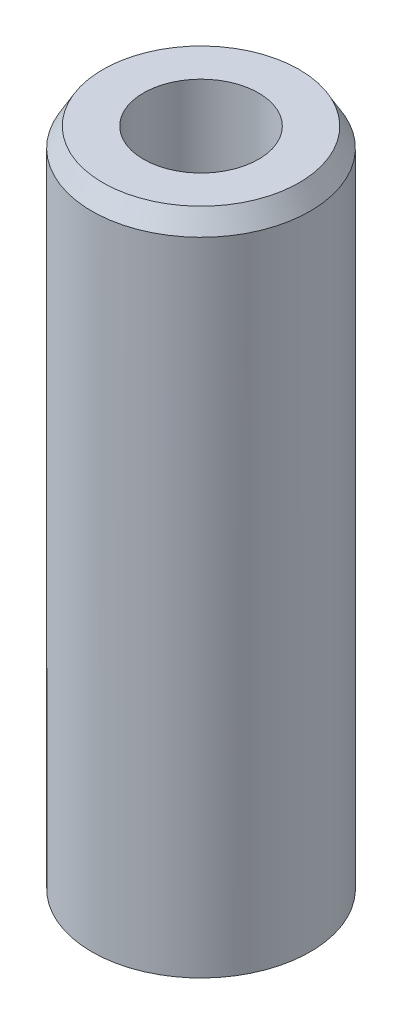
ISO-10303-21;
HEADER;
FILE_DESCRIPTION(('STEP AP214'),'2;1');
FILE_NAME('part.step','',(''),(''),'','','');
FILE_SCHEMA(('AUTOMOTIVE_DESIGN { 1 0 10303 214 1 1 1 1 }'));
ENDSEC;
DATA;
#1=APPLICATION_CONTEXT('core data for automotive mechanical design processes');
#2=APPLICATION_PROTOCOL_DEFINITION('international standard','automotive_design',2000,#1);
#3=PRODUCT_CONTEXT('',#1,'mechanical');
#4=PRODUCT('Part','Part','',(#3));
#5=PRODUCT_RELATED_PRODUCT_CATEGORY('part','',(#4));
#6=PRODUCT_DEFINITION_FORMATION('','',#4);
#7=PRODUCT_DEFINITION_CONTEXT('part definition',#1,'design');
#8=PRODUCT_DEFINITION('design','',#6,#7);
#9=PRODUCT_DEFINITION_SHAPE('','',#8);
#10=(LENGTH_UNIT() NAMED_UNIT(*) SI_UNIT(.MILLI.,.METRE.));
#11=(NAMED_UNIT(*) PLANE_ANGLE_UNIT() SI_UNIT($,.RADIAN.));
#12=(NAMED_UNIT(*) SI_UNIT($,.STERADIAN.) SOLID_ANGLE_UNIT());
#13=UNCERTAINTY_MEASURE_WITH_UNIT(LENGTH_MEASURE(1.E-05),#10,'distance_accuracy_value','');
#14=(GEOMETRIC_REPRESENTATION_CONTEXT(3) GLOBAL_UNCERTAINTY_ASSIGNED_CONTEXT((#13)) GLOBAL_UNIT_ASSIGNED_CONTEXT((#10,
#11,#12)) REPRESENTATION_CONTEXT('',''));
#15=CARTESIAN_POINT('',(0.,0.,0.));
#16=DIRECTION('',(0.,0.,1.));
#17=DIRECTION('',(1.,0.,0.));
#18=AXIS2_PLACEMENT_3D('',#15,#16,#17);
#19=CARTESIAN_POINT('',(0.,107.656707819467,0.));
#20=DIRECTION('',(0.,-1.,0.));
#21=DIRECTION('',(0.,0.,-1.));
#22=AXIS2_PLACEMENT_3D('',#19,#20,#21);
#23=CYLINDRICAL_SURFACE('',#22,17.5);
#24=CARTESIAN_POINT('',(0.,104.593815060946,0.));
#25=DIRECTION('',(0.,1.,0.));
#26=DIRECTION('',(0.,0.,1.));
#27=AXIS2_PLACEMENT_3D('',#24,#25,#26);
#28=CIRCLE('',#27,17.5);
#29=CARTESIAN_POINT('',(0.,104.593815060946,-17.5));
#30=VERTEX_POINT('',#29);
#31=EDGE_CURVE('E50',#30,#30,#28,.F.);
#32=CARTESIAN_POINT('',(0.,1.76836195863095,0.));
#33=DIRECTION('',(0.,1.,0.));
#34=DIRECTION('',(0.,0.,1.));
#35=AXIS2_PLACEMENT_3D('',#32,#33,#34);
#36=CIRCLE('',#35,17.5);
#37=CARTESIAN_POINT('',(0.,1.76836195863095,-17.5));
#38=VERTEX_POINT('',#37);
#39=EDGE_CURVE('E51',#38,#38,#36,.T.);
#40=CARTESIAN_POINT('',(0.,104.593815060946,-17.5));
#41=CARTESIAN_POINT('',(0.,103.52271659113,-17.5));
#42=CARTESIAN_POINT('',(0.,102.451618121315,-17.5));
#43=CARTESIAN_POINT('',(0.,100.309421181683,-17.5));
#44=CARTESIAN_POINT('',(0.,99.2383227118673,-17.5));
#45=CARTESIAN_POINT('',(0.,97.0961257722357,-17.5));
#46=CARTESIAN_POINT('',(0.,96.0250273024199,-17.5));
#47=CARTESIAN_POINT('',(0.,93.8828303627884,-17.5));
#48=CARTESIAN_POINT('',(0.,92.8117318929726,-17.5));
#49=CARTESIAN_POINT('',(0.,90.669534953341,-17.5));
#50=CARTESIAN_POINT('',(0.,89.5984364835252,-17.5));
#51=CARTESIAN_POINT('',(0.,87.4562395438937,-17.5));
#52=CARTESIAN_POINT('',(0.,86.3851410740779,-17.5));
#53=CARTESIAN_POINT('',(0.,84.2429441344463,-17.5));
#54=CARTESIAN_POINT('',(0.,83.1718456646305,-17.5));
#55=CARTESIAN_POINT('',(0.,81.029648724999,-17.5));
#56=CARTESIAN_POINT('',(0.,79.9585502551832,-17.5));
#57=CARTESIAN_POINT('',(0.,77.8163533155516,-17.5));
#58=CARTESIAN_POINT('',(0.,76.7452548457358,-17.5));
#59=CARTESIAN_POINT('',(0.,74.6030579061043,-17.5));
#60=CARTESIAN_POINT('',(0.,73.5319594362885,-17.5));
#61=CARTESIAN_POINT('',(0.,71.3897624966569,-17.5));
#62=CARTESIAN_POINT('',(0.,70.3186640268411,-17.5));
#63=CARTESIAN_POINT('',(0.,68.1764670872096,-17.5));
#64=CARTESIAN_POINT('',(0.,67.1053686173938,-17.5));
#65=CARTESIAN_POINT('',(0.,64.9631716777622,-17.5));
#66=CARTESIAN_POINT('',(0.,63.8920732079464,-17.5));
#67=CARTESIAN_POINT('',(0.,61.7498762683149,-17.5));
#68=CARTESIAN_POINT('',(0.,60.6787777984991,-17.5));
#69=CARTESIAN_POINT('',(0.,58.5365808588675,-17.5));
#70=CARTESIAN_POINT('',(0.,57.4654823890517,-17.5));
#71=CARTESIAN_POINT('',(0.,55.3232854494202,-17.5));
#72=CARTESIAN_POINT('',(0.,54.2521869796044,-17.5));
#73=CARTESIAN_POINT('',(0.,52.1099900399728,-17.5));
#74=CARTESIAN_POINT('',(0.,51.038891570157,-17.5));
#75=CARTESIAN_POINT('',(0.,48.8966946305254,-17.5));
#76=CARTESIAN_POINT('',(0.,47.8255961607097,-17.5));
#77=CARTESIAN_POINT('',(0.,45.6833992210781,-17.5));
#78=CARTESIAN_POINT('',(0.,44.6123007512623,-17.5));
#79=CARTESIAN_POINT('',(0.,42.4701038116307,-17.5));
#80=CARTESIAN_POINT('',(0.,41.399005341815,-17.5));
#81=CARTESIAN_POINT('',(0.,39.2568084021834,-17.5));
#82=CARTESIAN_POINT('',(0.,38.1857099323676,-17.5));
#83=CARTESIAN_POINT('',(0.,36.043512992736,-17.5));
#84=CARTESIAN_POINT('',(0.,34.9724145229203,-17.5));
#85=CARTESIAN_POINT('',(0.,32.8302175832887,-17.5));
#86=CARTESIAN_POINT('',(0.,31.7591191134729,-17.5));
#87=CARTESIAN_POINT('',(0.,29.6169221738413,-17.5));
#88=CARTESIAN_POINT('',(0.,28.5458237040255,-17.5));
#89=CARTESIAN_POINT('',(0.,26.403626764394,-17.5));
#90=CARTESIAN_POINT('',(0.,25.3325282945782,-17.5));
#91=CARTESIAN_POINT('',(0.,23.1903313549466,-17.5));
#92=CARTESIAN_POINT('',(0.,22.1192328851308,-17.5));
#93=CARTESIAN_POINT('',(0.,19.9770359454993,-17.5));
#94=CARTESIAN_POINT('',(0.,18.9059374756835,-17.5));
#95=CARTESIAN_POINT('',(0.,16.7637405360519,-17.5));
#96=CARTESIAN_POINT('',(0.,15.6926420662361,-17.5));
#97=CARTESIAN_POINT('',(0.,13.5504451266046,-17.5));
#98=CARTESIAN_POINT('',(0.,12.4793466567888,-17.5));
#99=CARTESIAN_POINT('',(0.,10.3371497171572,-17.5));
#100=CARTESIAN_POINT('',(0.,9.26605124734144,-17.5));
#101=CARTESIAN_POINT('',(0.,7.12385430770987,-17.5));
#102=CARTESIAN_POINT('',(0.,6.05275583789408,-17.5));
#103=CARTESIAN_POINT('',(0.,3.91055889826251,-17.5));
#104=CARTESIAN_POINT('',(0.,2.83946042844673,-17.5));
#105=CARTESIAN_POINT('',(0.,1.76836195863095,-17.5));
#106=B_SPLINE_CURVE_WITH_KNOTS('',3,(#40,#41,#42,#43,#44,#45,#46,#47,#48,#49,#50,#51,#52,#53,
#54,#55,#56,#57,#58,#59,#60,#61,#62,#63,#64,#65,#66,#67,#68,#69,#70,#71,#72,#73,#74,#75,#76,#77,
#78,#79,#80,#81,#82,#83,#84,#85,#86,#87,#88,#89,#90,#91,#92,#93,#94,#95,#96,#97,#98,#99,#100,
#101,#102,#103,#104,#105),.UNSPECIFIED.,.F.,.F.,(4,2,2,2,2,2,2,2,2,2,2,2,2,2,2,2,2,2,2,2,2,2,2,
2,2,2,2,2,2,2,2,2,4),(0.,3.21329540944736,6.42659081889471,9.63988622834207,12.8531816377894,
16.0664770472368,19.2797724566841,22.4930678661315,25.7063632755788,28.9196586850262,
32.1329540944735,35.3462495039209,38.5595449133682,41.7728403228156,44.9861357322629,
48.1994311417103,51.4127265511576,54.626021960605,57.8393173700523,61.0526127794997,
64.2659081889471,67.4792035983944,70.6924990078417,73.9057944172891,77.1190898267365,
80.3323852361838,83.5456806456312,86.7589760550785,89.9722714645259,93.1855668739732,
96.3988622834206,99.6121576928679,102.825453102315),.UNSPECIFIED.);
#107=EDGE_CURVE('BSEAM39',#30,#38,#106,.T.);
#108=ORIENTED_EDGE('',*,*,#31,.T.);
#109=ORIENTED_EDGE('',*,*,#39,.T.);
#110=ORIENTED_EDGE('',*,*,#107,.T.);
#111=ORIENTED_EDGE('',*,*,#107,.F.);
#112=EDGE_LOOP('',(#108,#110,#109,#111));
#113=FACE_BOUND('',#112,.T.);
#114=ADVANCED_FACE('F39',(#113),#23,.T.);
#115=CARTESIAN_POINT('',(0.,107.656707819467,0.));
#116=DIRECTION('',(0.,1.,0.));
#117=DIRECTION('',(0.,0.,1.));
#118=AXIS2_PLACEMENT_3D('',#115,#116,#117);
#119=PLANE('',#118);
#120=CARTESIAN_POINT('',(0.,107.656707819467,0.));
#121=DIRECTION('',(0.,1.,0.));
#122=DIRECTION('',(0.,0.,1.));
#123=AXIS2_PLACEMENT_3D('',#120,#121,#122);
#124=CIRCLE('',#123,15.7316380413691);
#125=CARTESIAN_POINT('',(0.,107.656707819467,-15.7316380413691));
#126=VERTEX_POINT('',#125);
#127=EDGE_CURVE('E54',#126,#126,#124,.T.);
#128=ORIENTED_EDGE('',*,*,#127,.T.);
#129=EDGE_LOOP('',(#128));
#130=FACE_BOUND('',#129,.T.);
#131=CARTESIAN_POINT('',(0.,107.656707819467,0.));
#132=DIRECTION('',(0.,1.,0.));
#133=DIRECTION('',(0.,0.,1.));
#134=AXIS2_PLACEMENT_3D('',#131,#132,#133);
#135=CIRCLE('',#134,9.22076036039989);
#136=CARTESIAN_POINT('',(0.,107.656707819467,9.22076036039989));
#137=VERTEX_POINT('',#136);
#138=EDGE_CURVE('E58',#137,#137,#135,.T.);
#139=ORIENTED_EDGE('',*,*,#138,.F.);
#140=EDGE_LOOP('',(#139));
#141=FACE_BOUND('',#140,.T.);
#142=ADVANCED_FACE('F69',(#130,#141),#119,.T.);
#143=CARTESIAN_POINT('',(0.,0.,0.));
#144=DIRECTION('',(0.,1.,0.));
#145=DIRECTION('',(0.,0.,1.));
#146=AXIS2_PLACEMENT_3D('',#143,#144,#145);
#147=PLANE('',#146);
#148=CARTESIAN_POINT('',(0.,0.,0.));
#149=DIRECTION('',(0.,1.,0.));
#150=DIRECTION('',(0.,0.,1.));
#151=AXIS2_PLACEMENT_3D('',#148,#149,#150);
#152=CIRCLE('',#151,14.4371072414791);
#153=CARTESIAN_POINT('',(0.,0.,14.4371072414791));
#154=VERTEX_POINT('',#153);
#155=EDGE_CURVE('E10',#154,#154,#152,.F.);
#156=ORIENTED_EDGE('',*,*,#155,.T.);
#157=EDGE_LOOP('',(#156));
#158=FACE_BOUND('',#157,.T.);
#159=CARTESIAN_POINT('',(0.,0.,0.));
#160=DIRECTION('',(0.,1.,0.));
#161=DIRECTION('',(0.,0.,1.));
#162=AXIS2_PLACEMENT_3D('',#159,#160,#161);
#163=CIRCLE('',#162,9.22076036039989);
#164=CARTESIAN_POINT('',(0.,0.,9.22076036039989));
#165=VERTEX_POINT('',#164);
#166=EDGE_CURVE('E63',#165,#165,#163,.T.);
#167=ORIENTED_EDGE('',*,*,#166,.T.);
#168=EDGE_LOOP('',(#167));
#169=FACE_BOUND('',#168,.T.);
#170=ADVANCED_FACE('F75',(#158,#169),#147,.F.);
#171=CARTESIAN_POINT('',(0.,107.656707819467,0.));
#172=DIRECTION('',(0.,-1.,0.));
#173=DIRECTION('',(0.,0.,-1.));
#174=AXIS2_PLACEMENT_3D('',#171,#172,#173);
#175=CYLINDRICAL_SURFACE('',#174,9.22076036039989);
#176=ORIENTED_EDGE('',*,*,#138,.T.);
#177=EDGE_LOOP('',(#176));
#178=FACE_BOUND('',#177,.T.);
#179=ORIENTED_EDGE('',*,*,#166,.F.);
#180=EDGE_LOOP('',(#179));
#181=FACE_BOUND('',#180,.T.);
#182=ADVANCED_FACE('F70',(#178,#181),#175,.F.);
#183=CARTESIAN_POINT('',(0.,107.656707819467,0.));
#184=DIRECTION('',(0.,-1.,0.));
#185=DIRECTION('',(0.,0.,-1.));
#186=AXIS2_PLACEMENT_3D('',#183,#184,#185);
#187=CONICAL_SURFACE('',#186,15.7316380413691,0.523598775598293);
#188=CARTESIAN_POINT('',(0.,104.593815060946,-17.5));
#189=CARTESIAN_POINT('',(0.,104.625720193847,-17.4815795629309));
#190=CARTESIAN_POINT('',(0.,104.657625326749,-17.4631591258619));
#191=CARTESIAN_POINT('',(0.,104.721435592551,-17.4263182517237));
#192=CARTESIAN_POINT('',(0.,104.753340725453,-17.4078978146546));
#193=CARTESIAN_POINT('',(0.,104.817150991255,-17.3710569405165));
#194=CARTESIAN_POINT('',(0.,104.849056124156,-17.3526365034474));
#195=CARTESIAN_POINT('',(0.,104.912866389959,-17.3157956293093));
#196=CARTESIAN_POINT('',(0.,104.94477152286,-17.2973751922402));
#197=CARTESIAN_POINT('',(0.,105.008581788663,-17.2605343181021));
#198=CARTESIAN_POINT('',(0.,105.040486921564,-17.242113881033));
#199=CARTESIAN_POINT('',(0.,105.104297187366,-17.2052730068949));
#200=CARTESIAN_POINT('',(0.,105.136202320268,-17.1868525698258));
#201=CARTESIAN_POINT('',(0.,105.20001258607,-17.1500116956876));
#202=CARTESIAN_POINT('',(0.,105.231917718971,-17.1315912586186));
#203=CARTESIAN_POINT('',(0.,105.295727984774,-17.0947503844804));
#204=CARTESIAN_POINT('',(0.,105.327633117675,-17.0763299474113));
#205=CARTESIAN_POINT('',(0.,105.391443383478,-17.0394890732732));
#206=CARTESIAN_POINT('',(0.,105.423348516379,-17.0210686362041));
#207=CARTESIAN_POINT('',(0.,105.487158782181,-16.984227762066));
#208=CARTESIAN_POINT('',(0.,105.519063915083,-16.9658073249969));
#209=CARTESIAN_POINT('',(0.,105.582874180885,-16.9289664508588));
#210=CARTESIAN_POINT('',(0.,105.614779313786,-16.9105460137897));
#211=CARTESIAN_POINT('',(0.,105.678589579589,-16.8737051396515));
#212=CARTESIAN_POINT('',(0.,105.71049471249,-16.8552847025825));
#213=CARTESIAN_POINT('',(0.,105.774304978293,-16.8184438284443));
#214=CARTESIAN_POINT('',(0.,105.806210111194,-16.8000233913753));
#215=CARTESIAN_POINT('',(0.,105.870020376997,-16.7631825172371));
#216=CARTESIAN_POINT('',(0.,105.901925509898,-16.744762080168));
#217=CARTESIAN_POINT('',(0.,105.9657357757,-16.7079212060299));
#218=CARTESIAN_POINT('',(0.,105.997640908602,-16.6895007689608));
#219=CARTESIAN_POINT('',(0.,106.061451174404,-16.6526598948227));
#220=CARTESIAN_POINT('',(0.,106.093356307305,-16.6342394577536));
#221=CARTESIAN_POINT('',(0.,106.157166573108,-16.5973985836155));
#222=CARTESIAN_POINT('',(0.,106.189071706009,-16.5789781465464));
#223=CARTESIAN_POINT('',(0.,106.252881971812,-16.5421372724083));
#224=CARTESIAN_POINT('',(0.,106.284787104713,-16.5237168353392));
#225=CARTESIAN_POINT('',(0.,106.348597370515,-16.486875961201));
#226=CARTESIAN_POINT('',(0.,106.380502503417,-16.468455524132));
#227=CARTESIAN_POINT('',(0.,106.444312769219,-16.4316146499938));
#228=CARTESIAN_POINT('',(0.,106.47621790212,-16.4131942129247));
#229=CARTESIAN_POINT('',(0.,106.540028167923,-16.3763533387866));
#230=CARTESIAN_POINT('',(0.,106.571933300824,-16.3579329017175));
#231=CARTESIAN_POINT('',(0.,106.635743566627,-16.3210920275794));
#232=CARTESIAN_POINT('',(0.,106.667648699528,-16.3026715905103));
#233=CARTESIAN_POINT('',(0.,106.731458965331,-16.2658307163722));
#234=CARTESIAN_POINT('',(0.,106.763364098232,-16.2474102793031));
#235=CARTESIAN_POINT('',(0.,106.827174364034,-16.2105694051649));
#236=CARTESIAN_POINT('',(0.,106.859079496936,-16.1921489680959));
#237=CARTESIAN_POINT('',(0.,106.922889762738,-16.1553080939577));
#238=CARTESIAN_POINT('',(0.,106.954794895639,-16.1368876568887));
#239=CARTESIAN_POINT('',(0.,107.018605161442,-16.1000467827505));
#240=CARTESIAN_POINT('',(0.,107.050510294343,-16.0816263456814));
#241=CARTESIAN_POINT('',(0.,107.114320560146,-16.0447854715433));
#242=CARTESIAN_POINT('',(0.,107.146225693047,-16.0263650344742));
#243=CARTESIAN_POINT('',(0.,107.210035958849,-15.9895241603361));
#244=CARTESIAN_POINT('',(0.,107.241941091751,-15.971103723267));
#245=CARTESIAN_POINT('',(0.,107.305751357553,-15.9342628491289));
#246=CARTESIAN_POINT('',(0.,107.337656490454,-15.9158424120598));
#247=CARTESIAN_POINT('',(0.,107.401466756257,-15.8790015379216));
#248=CARTESIAN_POINT('',(0.,107.433371889158,-15.8605811008526));
#249=CARTESIAN_POINT('',(0.,107.497182154961,-15.8237402267144));
#250=CARTESIAN_POINT('',(0.,107.529087287862,-15.8053197896454));
#251=CARTESIAN_POINT('',(0.,107.592897553665,-15.7684789155072));
#252=CARTESIAN_POINT('',(0.,107.624802686566,-15.7500584784381));
#253=CARTESIAN_POINT('',(0.,107.656707819467,-15.7316380413691));
#254=B_SPLINE_CURVE_WITH_KNOTS('',3,(#188,#189,#190,#191,#192,#193,#194,#195,#196,#197,#198,
#199,#200,#201,#202,#203,#204,#205,#206,#207,#208,#209,#210,#211,#212,#213,#214,#215,#216,#217,
#218,#219,#220,#221,#222,#223,#224,#225,#226,#227,#228,#229,#230,#231,#232,#233,#234,#235,#236,
#237,#238,#239,#240,#241,#242,#243,#244,#245,#246,#247,#248,#249,#250,#251,#252,#253),
.UNSPECIFIED.,.F.,.F.,(4,2,2,2,2,2,2,2,2,2,2,2,2,2,2,2,2,2,2,2,2,2,2,2,2,2,2,2,2,2,2,2,4),(0.,
0.110522622414445,0.221045244828879,0.331567867243311,0.442090489657744,0.552613112072178,
0.663135734486611,0.773658356901044,0.884180979315478,0.994703601729923,1.10522622414436,
1.21574884655879,1.32627146897322,1.43679409138766,1.54731671380209,1.65783933621652,
1.76836195863096,1.8788845810454,1.98940720345983,2.09992982587427,2.2104524482887,
2.32097507070313,2.43149769311757,2.542020315532,2.65254293794645,2.76306556036088,
2.87358818277531,2.98411080518975,3.09463342760418,3.20515605001861,3.31567867243305,
3.42620129484748,3.53672391726192),.UNSPECIFIED.);
#255=EDGE_CURVE('BSEAM81',#30,#126,#254,.T.);
#256=ORIENTED_EDGE('',*,*,#31,.F.);
#257=ORIENTED_EDGE('',*,*,#127,.F.);
#258=ORIENTED_EDGE('',*,*,#255,.T.);
#259=ORIENTED_EDGE('',*,*,#255,.F.);
#260=EDGE_LOOP('',(#256,#258,#257,#259));
#261=FACE_BOUND('',#260,.T.);
#262=ADVANCED_FACE('F81',(#261),#187,.T.);
#263=CARTESIAN_POINT('',(0.,1.76836195863095,0.));
#264=DIRECTION('',(0.,1.,0.));
#265=DIRECTION('',(0.,0.,1.));
#266=AXIS2_PLACEMENT_3D('',#263,#264,#265);
#267=CONICAL_SURFACE('',#266,17.5,1.0471975511966);
#268=ORIENTED_EDGE('',*,*,#155,.F.);
#269=EDGE_LOOP('',(#268));
#270=FACE_BOUND('',#269,.T.);
#271=ORIENTED_EDGE('',*,*,#39,.F.);
#272=EDGE_LOOP('',(#271));
#273=FACE_BOUND('',#272,.T.);
#274=ADVANCED_FACE('F45',(#270,#273),#267,.T.);
#275=CLOSED_SHELL('',(#114,#142,#170,#182,#262,#274));
#276=MANIFOLD_SOLID_BREP('B2',#275);
#277=ADVANCED_BREP_SHAPE_REPRESENTATION('',(#18,#276),#14);
#278=SHAPE_DEFINITION_REPRESENTATION(#9,#277);
ENDSEC;
END-ISO-10303-21;
